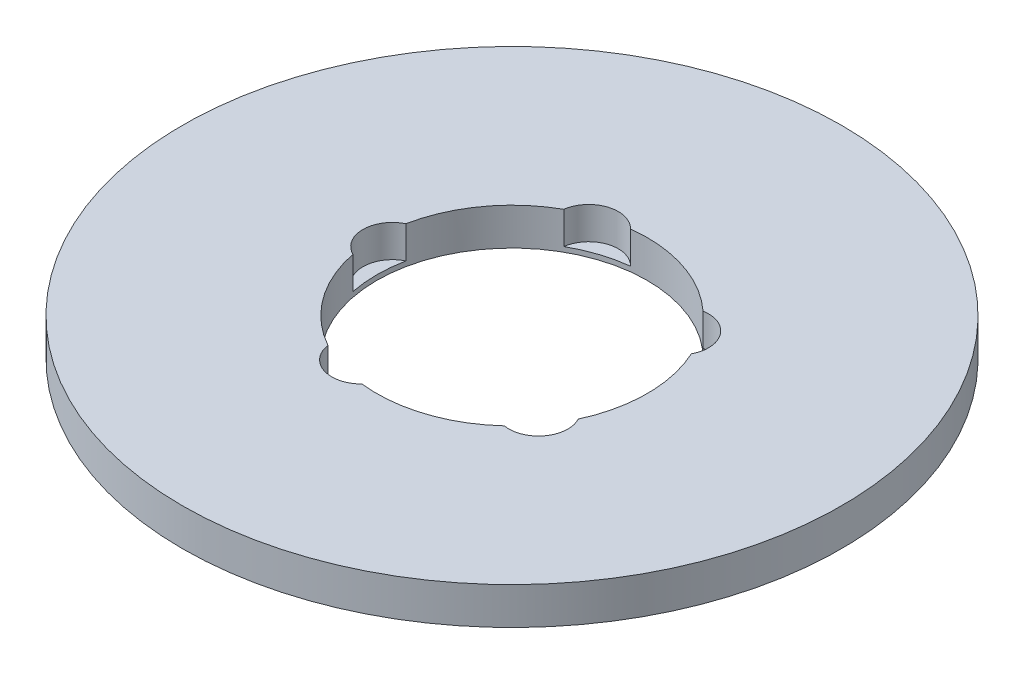
ISO-10303-21;
HEADER;
FILE_DESCRIPTION(('STEP AP214'),'2;1');
FILE_NAME('part.step','',(''),(''),'','','');
FILE_SCHEMA(('AUTOMOTIVE_DESIGN { 1 0 10303 214 1 1 1 1 }'));
ENDSEC;
DATA;
#1=APPLICATION_CONTEXT('core data for automotive mechanical design processes');
#2=APPLICATION_PROTOCOL_DEFINITION('international standard','automotive_design',2000,#1);
#3=PRODUCT_CONTEXT('',#1,'mechanical');
#4=PRODUCT('Part','Part','',(#3));
#5=PRODUCT_RELATED_PRODUCT_CATEGORY('part','',(#4));
#6=PRODUCT_DEFINITION_FORMATION('','',#4);
#7=PRODUCT_DEFINITION_CONTEXT('part definition',#1,'design');
#8=PRODUCT_DEFINITION('design','',#6,#7);
#9=PRODUCT_DEFINITION_SHAPE('','',#8);
#10=(LENGTH_UNIT() NAMED_UNIT(*) SI_UNIT(.MILLI.,.METRE.));
#11=(NAMED_UNIT(*) PLANE_ANGLE_UNIT() SI_UNIT($,.RADIAN.));
#12=(NAMED_UNIT(*) SI_UNIT($,.STERADIAN.) SOLID_ANGLE_UNIT());
#13=UNCERTAINTY_MEASURE_WITH_UNIT(LENGTH_MEASURE(1.E-05),#10,'distance_accuracy_value','');
#14=(GEOMETRIC_REPRESENTATION_CONTEXT(3) GLOBAL_UNCERTAINTY_ASSIGNED_CONTEXT((#13)) GLOBAL_UNIT_ASSIGNED_CONTEXT((#10,
#11,#12)) REPRESENTATION_CONTEXT('',''));
#15=CARTESIAN_POINT('',(0.,0.,0.));
#16=DIRECTION('',(0.,0.,1.));
#17=DIRECTION('',(1.,0.,0.));
#18=AXIS2_PLACEMENT_3D('',#15,#16,#17);
#19=CARTESIAN_POINT('',(0.,11.,0.));
#20=DIRECTION('',(0.,-1.,0.));
#21=DIRECTION('',(0.,0.,-1.));
#22=AXIS2_PLACEMENT_3D('',#19,#20,#21);
#23=CYLINDRICAL_SURFACE('',#22,97.5);
#24=CARTESIAN_POINT('',(0.,11.,0.));
#25=DIRECTION('',(0.,1.,0.));
#26=DIRECTION('',(0.,0.,1.));
#27=AXIS2_PLACEMENT_3D('',#24,#25,#26);
#28=CIRCLE('',#27,97.5);
#29=CARTESIAN_POINT('',(0.,11.,97.5));
#30=VERTEX_POINT('',#29);
#31=EDGE_CURVE('E151',#30,#30,#28,.T.);
#32=ORIENTED_EDGE('',*,*,#31,.F.);
#33=EDGE_LOOP('',(#32));
#34=FACE_BOUND('',#33,.T.);
#35=CARTESIAN_POINT('',(0.,0.,0.));
#36=DIRECTION('',(0.,1.,0.));
#37=DIRECTION('',(0.,0.,1.));
#38=AXIS2_PLACEMENT_3D('',#35,#36,#37);
#39=CIRCLE('',#38,97.5);
#40=CARTESIAN_POINT('',(0.,0.,97.5));
#41=VERTEX_POINT('',#40);
#42=EDGE_CURVE('E150',#41,#41,#39,.T.);
#43=ORIENTED_EDGE('',*,*,#42,.T.);
#44=EDGE_LOOP('',(#43));
#45=FACE_BOUND('',#44,.T.);
#46=ADVANCED_FACE('F39',(#34,#45),#23,.T.);
#47=CARTESIAN_POINT('',(0.,11.,0.));
#48=DIRECTION('',(0.,1.,0.));
#49=DIRECTION('',(0.,0.,1.));
#50=AXIS2_PLACEMENT_3D('',#47,#48,#49);
#51=PLANE('',#50);
#52=CARTESIAN_POINT('',(-10.9350754892846,11.,-33.6547018111385));
#53=DIRECTION('',(0.,1.,0.));
#54=DIRECTION('',(-0.95105651629515,0.,0.309016994374958));
#55=AXIS2_PLACEMENT_3D('',#52,#53,#54);
#56=CIRCLE('',#55,8.72427397907877);
#57=CARTESIAN_POINT('',(-4.67031394252228,11.,-39.7264164968133));
#58=VERTEX_POINT('',#57);
#59=CARTESIAN_POINT('',(-19.5722383946893,11.,-34.8844877305293));
#60=VERTEX_POINT('',#59);
#61=EDGE_CURVE('E196',#58,#60,#56,.T.);
#62=ORIENTED_EDGE('',*,*,#61,.F.);
#63=CARTESIAN_POINT('',(0.,11.,0.));
#64=DIRECTION('',(0.,1.,0.));
#65=DIRECTION('',(0.,0.,1.));
#66=AXIS2_PLACEMENT_3D('',#63,#64,#65);
#67=CIRCLE('',#66,40.);
#68=CARTESIAN_POINT('',(27.1289650918215,11.,-29.3942044125493));
#69=VERTEX_POINT('',#68);
#70=EDGE_CURVE('E156',#69,#58,#67,.T.);
#71=ORIENTED_EDGE('',*,*,#70,.F.);
#72=CARTESIAN_POINT('',(28.6283993004918,11.,-20.7997496005266));
#73=DIRECTION('',(0.,1.,0.));
#74=DIRECTION('',(-0.58778525229248,0.,-0.809016994374942));
#75=AXIS2_PLACEMENT_3D('',#72,#73,#74);
#76=CIRCLE('',#75,8.72427397907877);
#77=CARTESIAN_POINT('',(36.338860901044,11.,-16.7178703313124));
#78=VERTEX_POINT('',#77);
#79=EDGE_CURVE('E254',#78,#69,#76,.T.);
#80=ORIENTED_EDGE('',*,*,#79,.F.);
#81=CARTESIAN_POINT('',(36.3388609010442,11.,16.7178703313119));
#82=VERTEX_POINT('',#81);
#83=EDGE_CURVE('E153',#82,#78,#67,.T.);
#84=ORIENTED_EDGE('',*,*,#83,.F.);
#85=CARTESIAN_POINT('',(28.6283993004921,11.,20.7997496005262));
#86=DIRECTION('',(0.,1.,0.));
#87=DIRECTION('',(0.587785252292469,0.,-0.809016994374951));
#88=AXIS2_PLACEMENT_3D('',#85,#86,#87);
#89=CIRCLE('',#88,8.72427397907877);
#90=CARTESIAN_POINT('',(27.1289650918219,11.,29.3942044125489));
#91=VERTEX_POINT('',#90);
#92=EDGE_CURVE('E248',#91,#82,#89,.T.);
#93=ORIENTED_EDGE('',*,*,#92,.F.);
#94=CARTESIAN_POINT('',(-4.67031394252172,11.,39.7264164968134));
#95=VERTEX_POINT('',#94);
#96=EDGE_CURVE('E140',#95,#91,#67,.T.);
#97=ORIENTED_EDGE('',*,*,#96,.F.);
#98=CARTESIAN_POINT('',(-10.9350754892841,11.,33.6547018111387));
#99=DIRECTION('',(0.,1.,0.));
#100=DIRECTION('',(0.951056516295155,0.,0.309016994374945));
#101=AXIS2_PLACEMENT_3D('',#98,#99,#100);
#102=CIRCLE('',#101,8.72427397907877);
#103=CARTESIAN_POINT('',(-19.5722383946888,11.,34.8844877305296));
#104=VERTEX_POINT('',#103);
#105=EDGE_CURVE('E117',#104,#95,#102,.T.);
#106=ORIENTED_EDGE('',*,*,#105,.F.);
#107=CARTESIAN_POINT('',(-39.2252736556552,11.,7.8344053149531));
#108=VERTEX_POINT('',#107);
#109=EDGE_CURVE('E133',#108,#104,#67,.T.);
#110=ORIENTED_EDGE('',*,*,#109,.F.);
#111=CARTESIAN_POINT('',(-35.3866476224155,11.,0.));
#112=DIRECTION('',(0.,1.,0.));
#113=DIRECTION('',(0.,0.,1.));
#114=AXIS2_PLACEMENT_3D('',#111,#112,#113);
#115=CIRCLE('',#114,8.72427397907877);
#116=CARTESIAN_POINT('',(-39.2252736556552,11.,-7.8344053149531));
#117=VERTEX_POINT('',#116);
#118=EDGE_CURVE('E170',#117,#108,#115,.T.);
#119=ORIENTED_EDGE('',*,*,#118,.F.);
#120=EDGE_CURVE('E149',#60,#117,#67,.T.);
#121=ORIENTED_EDGE('',*,*,#120,.F.);
#122=EDGE_LOOP('',(#62,#71,#80,#84,#93,#97,#106,#110,#119,#121));
#123=FACE_BOUND('',#122,.T.);
#124=ORIENTED_EDGE('',*,*,#31,.T.);
#125=EDGE_LOOP('',(#124));
#126=FACE_BOUND('',#125,.T.);
#127=ADVANCED_FACE('F131',(#123,#126),#51,.T.);
#128=CARTESIAN_POINT('',(0.,0.,0.));
#129=DIRECTION('',(0.,1.,0.));
#130=DIRECTION('',(0.,0.,1.));
#131=AXIS2_PLACEMENT_3D('',#128,#129,#130);
#132=PLANE('',#131);
#133=CARTESIAN_POINT('',(0.,0.,0.));
#134=DIRECTION('',(0.,1.,0.));
#135=DIRECTION('',(0.,0.,1.));
#136=AXIS2_PLACEMENT_3D('',#133,#134,#135);
#137=CIRCLE('',#136,40.);
#138=CARTESIAN_POINT('',(0.,0.,40.));
#139=VERTEX_POINT('',#138);
#140=EDGE_CURVE('E160',#139,#139,#137,.T.);
#141=ORIENTED_EDGE('',*,*,#140,.T.);
#142=EDGE_LOOP('',(#141));
#143=FACE_BOUND('',#142,.T.);
#144=ORIENTED_EDGE('',*,*,#42,.F.);
#145=EDGE_LOOP('',(#144));
#146=FACE_BOUND('',#145,.T.);
#147=ADVANCED_FACE('F212',(#143,#146),#132,.F.);
#148=CARTESIAN_POINT('',(0.,11.,0.));
#149=DIRECTION('',(0.,-1.,0.));
#150=DIRECTION('',(0.,0.,-1.));
#151=AXIS2_PLACEMENT_3D('',#148,#149,#150);
#152=CYLINDRICAL_SURFACE('',#151,40.);
#153=DIRECTION('',(0.,1.,0.));
#154=VECTOR('',#153,1.);
#155=CARTESIAN_POINT('',(-4.67031394252228,6.22649560049626,-39.7264164968133));
#156=LINE('',#155,#154);
#157=CARTESIAN_POINT('',(-4.67031394252228,1.45299120099252,-39.7264164968133));
#158=VERTEX_POINT('',#157);
#159=EDGE_CURVE('E11',#158,#58,#156,.T.);
#160=ORIENTED_EDGE('',*,*,#159,.F.);
#161=CARTESIAN_POINT('',(0.,1.45299120099252,0.));
#162=DIRECTION('',(0.,1.,0.));
#163=DIRECTION('',(0.,0.,1.));
#164=AXIS2_PLACEMENT_3D('',#161,#162,#163);
#165=CIRCLE('',#164,40.);
#166=CARTESIAN_POINT('',(-19.5722383946893,1.45299120099252,-34.8844877305293));
#167=VERTEX_POINT('',#166);
#168=EDGE_CURVE('E193',#158,#167,#165,.T.);
#169=ORIENTED_EDGE('',*,*,#168,.T.);
#170=DIRECTION('',(0.,1.,0.));
#171=VECTOR('',#170,1.);
#172=CARTESIAN_POINT('',(-19.5722383946893,6.22649560049626,-34.8844877305293));
#173=LINE('',#172,#171);
#174=EDGE_CURVE('E46',#60,#167,#173,.F.);
#175=ORIENTED_EDGE('',*,*,#174,.F.);
#176=ORIENTED_EDGE('',*,*,#120,.T.);
#177=DIRECTION('',(0.,1.,0.));
#178=VECTOR('',#177,1.);
#179=CARTESIAN_POINT('',(-39.2252736556552,6.22649560049626,-7.8344053149531));
#180=LINE('',#179,#178);
#181=CARTESIAN_POINT('',(-39.2252736556552,1.45299120099252,-7.8344053149531));
#182=VERTEX_POINT('',#181);
#183=EDGE_CURVE('E174',#182,#117,#180,.T.);
#184=ORIENTED_EDGE('',*,*,#183,.F.);
#185=CARTESIAN_POINT('',(0.,1.45299120099252,0.));
#186=DIRECTION('',(0.,1.,0.));
#187=DIRECTION('',(0.,0.,1.));
#188=AXIS2_PLACEMENT_3D('',#185,#186,#187);
#189=CIRCLE('',#188,40.);
#190=CARTESIAN_POINT('',(-39.2252736556552,1.45299120099252,7.8344053149531));
#191=VERTEX_POINT('',#190);
#192=EDGE_CURVE('E171',#182,#191,#189,.T.);
#193=ORIENTED_EDGE('',*,*,#192,.T.);
#194=DIRECTION('',(0.,1.,0.));
#195=VECTOR('',#194,1.);
#196=CARTESIAN_POINT('',(-39.2252736556552,6.22649560049626,7.8344053149531));
#197=LINE('',#196,#195);
#198=EDGE_CURVE('E148',#108,#191,#197,.F.);
#199=ORIENTED_EDGE('',*,*,#198,.F.);
#200=ORIENTED_EDGE('',*,*,#109,.T.);
#201=DIRECTION('',(0.,1.,0.));
#202=VECTOR('',#201,1.);
#203=CARTESIAN_POINT('',(-19.5722383946888,6.22649560049626,34.8844877305296));
#204=LINE('',#203,#202);
#205=CARTESIAN_POINT('',(-19.5722383946888,1.45299120099252,34.8844877305296));
#206=VERTEX_POINT('',#205);
#207=EDGE_CURVE('E111',#206,#104,#204,.T.);
#208=ORIENTED_EDGE('',*,*,#207,.F.);
#209=CARTESIAN_POINT('',(0.,1.45299120099252,0.));
#210=DIRECTION('',(0.,1.,0.));
#211=DIRECTION('',(0.,0.,1.));
#212=AXIS2_PLACEMENT_3D('',#209,#210,#211);
#213=CIRCLE('',#212,40.);
#214=CARTESIAN_POINT('',(-4.67031394252172,1.45299120099252,39.7264164968134));
#215=VERTEX_POINT('',#214);
#216=EDGE_CURVE('E180',#206,#215,#213,.T.);
#217=ORIENTED_EDGE('',*,*,#216,.T.);
#218=DIRECTION('',(0.,1.,0.));
#219=VECTOR('',#218,1.);
#220=CARTESIAN_POINT('',(-4.67031394252172,6.22649560049626,39.7264164968134));
#221=LINE('',#220,#219);
#222=EDGE_CURVE('E124',#95,#215,#221,.F.);
#223=ORIENTED_EDGE('',*,*,#222,.F.);
#224=ORIENTED_EDGE('',*,*,#96,.T.);
#225=DIRECTION('',(0.,1.,0.));
#226=VECTOR('',#225,1.);
#227=CARTESIAN_POINT('',(27.1289650918219,6.22649560049626,29.3942044125489));
#228=LINE('',#227,#226);
#229=CARTESIAN_POINT('',(27.1289650918219,1.45299120099252,29.3942044125489));
#230=VERTEX_POINT('',#229);
#231=EDGE_CURVE('E183',#230,#91,#228,.T.);
#232=ORIENTED_EDGE('',*,*,#231,.F.);
#233=CARTESIAN_POINT('',(0.,1.45299120099252,0.));
#234=DIRECTION('',(0.,1.,0.));
#235=DIRECTION('',(0.,0.,1.));
#236=AXIS2_PLACEMENT_3D('',#233,#234,#235);
#237=CIRCLE('',#236,40.);
#238=CARTESIAN_POINT('',(36.3388609010442,1.45299120099252,16.7178703313119));
#239=VERTEX_POINT('',#238);
#240=EDGE_CURVE('E123',#230,#239,#237,.T.);
#241=ORIENTED_EDGE('',*,*,#240,.T.);
#242=DIRECTION('',(0.,1.,0.));
#243=VECTOR('',#242,1.);
#244=CARTESIAN_POINT('',(36.3388609010442,6.22649560049626,16.7178703313119));
#245=LINE('',#244,#243);
#246=EDGE_CURVE('E185',#82,#239,#245,.F.);
#247=ORIENTED_EDGE('',*,*,#246,.F.);
#248=ORIENTED_EDGE('',*,*,#83,.T.);
#249=DIRECTION('',(0.,1.,0.));
#250=VECTOR('',#249,1.);
#251=CARTESIAN_POINT('',(36.338860901044,6.22649560049626,-16.7178703313124));
#252=LINE('',#251,#250);
#253=CARTESIAN_POINT('',(36.338860901044,1.45299120099252,-16.7178703313124));
#254=VERTEX_POINT('',#253);
#255=EDGE_CURVE('E195',#254,#78,#252,.T.);
#256=ORIENTED_EDGE('',*,*,#255,.F.);
#257=CARTESIAN_POINT('',(0.,1.45299120099252,0.));
#258=DIRECTION('',(0.,1.,0.));
#259=DIRECTION('',(0.,0.,1.));
#260=AXIS2_PLACEMENT_3D('',#257,#258,#259);
#261=CIRCLE('',#260,40.);
#262=CARTESIAN_POINT('',(27.1289650918215,1.45299120099252,-29.3942044125493));
#263=VERTEX_POINT('',#262);
#264=EDGE_CURVE('E190',#254,#263,#261,.T.);
#265=ORIENTED_EDGE('',*,*,#264,.T.);
#266=DIRECTION('',(0.,1.,0.));
#267=VECTOR('',#266,1.);
#268=CARTESIAN_POINT('',(27.1289650918215,6.22649560049626,-29.3942044125493));
#269=LINE('',#268,#267);
#270=EDGE_CURVE('E189',#69,#263,#269,.F.);
#271=ORIENTED_EDGE('',*,*,#270,.F.);
#272=ORIENTED_EDGE('',*,*,#70,.T.);
#273=EDGE_LOOP('',(#160,#169,#175,#176,#184,#193,#199,#200,#208,#217,#223,#224,#232,#241,#247,
#248,#256,#265,#271,#272));
#274=FACE_BOUND('',#273,.T.);
#275=ORIENTED_EDGE('',*,*,#140,.F.);
#276=EDGE_LOOP('',(#275));
#277=FACE_BOUND('',#276,.T.);
#278=ADVANCED_FACE('F142',(#274,#277),#152,.F.);
#279=CARTESIAN_POINT('',(-35.3866476224155,1.45299120099252,0.));
#280=DIRECTION('',(0.,1.,0.));
#281=DIRECTION('',(0.,0.,1.));
#282=AXIS2_PLACEMENT_3D('',#279,#280,#281);
#283=CYLINDRICAL_SURFACE('',#282,8.72427397907877);
#284=ORIENTED_EDGE('',*,*,#183,.T.);
#285=ORIENTED_EDGE('',*,*,#118,.T.);
#286=ORIENTED_EDGE('',*,*,#198,.T.);
#287=CARTESIAN_POINT('',(-35.3866476224155,1.45299120099252,0.));
#288=DIRECTION('',(0.,1.,0.));
#289=DIRECTION('',(0.,0.,1.));
#290=AXIS2_PLACEMENT_3D('',#287,#288,#289);
#291=CIRCLE('',#290,8.72427397907877);
#292=EDGE_CURVE('E163',#182,#191,#291,.T.);
#293=ORIENTED_EDGE('',*,*,#292,.F.);
#294=EDGE_LOOP('',(#284,#285,#286,#293));
#295=FACE_BOUND('',#294,.T.);
#296=ADVANCED_FACE('F221',(#295),#283,.F.);
#297=CARTESIAN_POINT('',(-35.3866476224155,1.45299120099252,0.));
#298=DIRECTION('',(0.,1.,0.));
#299=DIRECTION('',(0.,0.,1.));
#300=AXIS2_PLACEMENT_3D('',#297,#298,#299);
#301=PLANE('',#300);
#302=ORIENTED_EDGE('',*,*,#292,.T.);
#303=ORIENTED_EDGE('',*,*,#192,.F.);
#304=EDGE_LOOP('',(#302,#303));
#305=FACE_BOUND('',#304,.T.);
#306=ADVANCED_FACE('F227',(#305),#301,.T.);
#307=CARTESIAN_POINT('',(-10.9350754892841,1.45299120099252,33.6547018111387));
#308=DIRECTION('',(0.,1.,0.));
#309=DIRECTION('',(0.,0.,1.));
#310=AXIS2_PLACEMENT_3D('',#307,#308,#309);
#311=CYLINDRICAL_SURFACE('',#310,8.72427397907877);
#312=ORIENTED_EDGE('',*,*,#207,.T.);
#313=ORIENTED_EDGE('',*,*,#105,.T.);
#314=ORIENTED_EDGE('',*,*,#222,.T.);
#315=CARTESIAN_POINT('',(-10.9350754892841,1.45299120099252,33.6547018111387));
#316=DIRECTION('',(0.,1.,0.));
#317=DIRECTION('',(0.951056516295155,0.,0.309016994374945));
#318=AXIS2_PLACEMENT_3D('',#315,#316,#317);
#319=CIRCLE('',#318,8.72427397907877);
#320=EDGE_CURVE('E119',#206,#215,#319,.T.);
#321=ORIENTED_EDGE('',*,*,#320,.F.);
#322=EDGE_LOOP('',(#312,#313,#314,#321));
#323=FACE_BOUND('',#322,.T.);
#324=ADVANCED_FACE('F116',(#323),#311,.F.);
#325=CARTESIAN_POINT('',(-10.9350754892841,1.45299120099252,33.6547018111387));
#326=DIRECTION('',(0.,1.,0.));
#327=DIRECTION('',(0.951056516295155,0.,0.309016994374945));
#328=AXIS2_PLACEMENT_3D('',#325,#326,#327);
#329=PLANE('',#328);
#330=ORIENTED_EDGE('',*,*,#320,.T.);
#331=ORIENTED_EDGE('',*,*,#216,.F.);
#332=EDGE_LOOP('',(#330,#331));
#333=FACE_BOUND('',#332,.T.);
#334=ADVANCED_FACE('F234',(#333),#329,.T.);
#335=CARTESIAN_POINT('',(28.6283993004921,1.45299120099252,20.7997496005262));
#336=DIRECTION('',(0.,1.,0.));
#337=DIRECTION('',(0.,0.,1.));
#338=AXIS2_PLACEMENT_3D('',#335,#336,#337);
#339=CYLINDRICAL_SURFACE('',#338,8.72427397907877);
#340=ORIENTED_EDGE('',*,*,#231,.T.);
#341=ORIENTED_EDGE('',*,*,#92,.T.);
#342=ORIENTED_EDGE('',*,*,#246,.T.);
#343=CARTESIAN_POINT('',(28.6283993004921,1.45299120099252,20.7997496005262));
#344=DIRECTION('',(0.,1.,0.));
#345=DIRECTION('',(0.587785252292469,0.,-0.809016994374951));
#346=AXIS2_PLACEMENT_3D('',#343,#344,#345);
#347=CIRCLE('',#346,8.72427397907877);
#348=EDGE_CURVE('E137',#230,#239,#347,.T.);
#349=ORIENTED_EDGE('',*,*,#348,.F.);
#350=EDGE_LOOP('',(#340,#341,#342,#349));
#351=FACE_BOUND('',#350,.T.);
#352=ADVANCED_FACE('F240',(#351),#339,.F.);
#353=CARTESIAN_POINT('',(28.6283993004921,1.45299120099252,20.7997496005262));
#354=DIRECTION('',(0.,1.,0.));
#355=DIRECTION('',(0.587785252292469,0.,-0.809016994374951));
#356=AXIS2_PLACEMENT_3D('',#353,#354,#355);
#357=PLANE('',#356);
#358=ORIENTED_EDGE('',*,*,#348,.T.);
#359=ORIENTED_EDGE('',*,*,#240,.F.);
#360=EDGE_LOOP('',(#358,#359));
#361=FACE_BOUND('',#360,.T.);
#362=ADVANCED_FACE('F245',(#361),#357,.T.);
#363=CARTESIAN_POINT('',(28.6283993004918,1.45299120099252,-20.7997496005266));
#364=DIRECTION('',(0.,1.,0.));
#365=DIRECTION('',(0.,0.,1.));
#366=AXIS2_PLACEMENT_3D('',#363,#364,#365);
#367=CYLINDRICAL_SURFACE('',#366,8.72427397907877);
#368=ORIENTED_EDGE('',*,*,#255,.T.);
#369=ORIENTED_EDGE('',*,*,#79,.T.);
#370=ORIENTED_EDGE('',*,*,#270,.T.);
#371=CARTESIAN_POINT('',(28.6283993004918,1.45299120099252,-20.7997496005266));
#372=DIRECTION('',(0.,1.,0.));
#373=DIRECTION('',(-0.58778525229248,0.,-0.809016994374942));
#374=AXIS2_PLACEMENT_3D('',#371,#372,#373);
#375=CIRCLE('',#374,8.72427397907877);
#376=EDGE_CURVE('E56',#254,#263,#375,.T.);
#377=ORIENTED_EDGE('',*,*,#376,.F.);
#378=EDGE_LOOP('',(#368,#369,#370,#377));
#379=FACE_BOUND('',#378,.T.);
#380=ADVANCED_FACE('F264',(#379),#367,.F.);
#381=CARTESIAN_POINT('',(28.6283993004918,1.45299120099252,-20.7997496005266));
#382=DIRECTION('',(0.,1.,0.));
#383=DIRECTION('',(-0.58778525229248,0.,-0.809016994374942));
#384=AXIS2_PLACEMENT_3D('',#381,#382,#383);
#385=PLANE('',#384);
#386=ORIENTED_EDGE('',*,*,#376,.T.);
#387=ORIENTED_EDGE('',*,*,#264,.F.);
#388=EDGE_LOOP('',(#386,#387));
#389=FACE_BOUND('',#388,.T.);
#390=ADVANCED_FACE('F202',(#389),#385,.T.);
#391=CARTESIAN_POINT('',(-10.9350754892846,1.45299120099252,-33.6547018111385));
#392=DIRECTION('',(0.,1.,0.));
#393=DIRECTION('',(0.,0.,1.));
#394=AXIS2_PLACEMENT_3D('',#391,#392,#393);
#395=CYLINDRICAL_SURFACE('',#394,8.72427397907877);
#396=ORIENTED_EDGE('',*,*,#159,.T.);
#397=ORIENTED_EDGE('',*,*,#61,.T.);
#398=ORIENTED_EDGE('',*,*,#174,.T.);
#399=CARTESIAN_POINT('',(-10.9350754892846,1.45299120099252,-33.6547018111385));
#400=DIRECTION('',(0.,1.,0.));
#401=DIRECTION('',(-0.95105651629515,0.,0.309016994374958));
#402=AXIS2_PLACEMENT_3D('',#399,#400,#401);
#403=CIRCLE('',#402,8.72427397907877);
#404=EDGE_CURVE('E55',#158,#167,#403,.T.);
#405=ORIENTED_EDGE('',*,*,#404,.F.);
#406=EDGE_LOOP('',(#396,#397,#398,#405));
#407=FACE_BOUND('',#406,.T.);
#408=ADVANCED_FACE('F197',(#407),#395,.F.);
#409=CARTESIAN_POINT('',(-10.9350754892846,1.45299120099252,-33.6547018111385));
#410=DIRECTION('',(0.,1.,0.));
#411=DIRECTION('',(-0.95105651629515,0.,0.309016994374958));
#412=AXIS2_PLACEMENT_3D('',#409,#410,#411);
#413=PLANE('',#412);
#414=ORIENTED_EDGE('',*,*,#404,.T.);
#415=ORIENTED_EDGE('',*,*,#168,.F.);
#416=EDGE_LOOP('',(#414,#415));
#417=FACE_BOUND('',#416,.T.);
#418=ADVANCED_FACE('F200',(#417),#413,.T.);
#419=CLOSED_SHELL('',(#46,#127,#147,#278,#296,#306,#324,#334,#352,#362,#380,#390,#408,#418));
#420=MANIFOLD_SOLID_BREP('B2',#419);
#421=ADVANCED_BREP_SHAPE_REPRESENTATION('',(#18,#420),#14);
#422=SHAPE_DEFINITION_REPRESENTATION(#9,#421);
ENDSEC;
END-ISO-10303-21;
